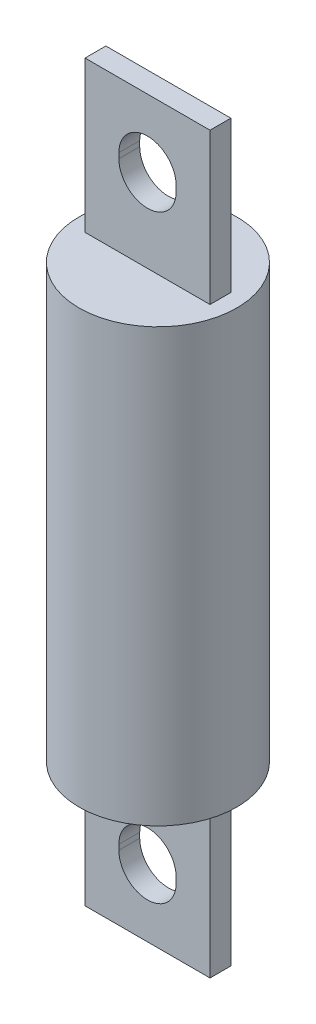
ISO-10303-21;
HEADER;
FILE_DESCRIPTION(('STEP AP214'),'2;1');
FILE_NAME('part.step','',(''),(''),'','','');
FILE_SCHEMA(('AUTOMOTIVE_DESIGN { 1 0 10303 214 1 1 1 1 }'));
ENDSEC;
DATA;
#1=APPLICATION_CONTEXT('core data for automotive mechanical design processes');
#2=APPLICATION_PROTOCOL_DEFINITION('international standard','automotive_design',2000,#1);
#3=PRODUCT_CONTEXT('',#1,'mechanical');
#4=PRODUCT('Part','Part','',(#3));
#5=PRODUCT_RELATED_PRODUCT_CATEGORY('part','',(#4));
#6=PRODUCT_DEFINITION_FORMATION('','',#4);
#7=PRODUCT_DEFINITION_CONTEXT('part definition',#1,'design');
#8=PRODUCT_DEFINITION('design','',#6,#7);
#9=PRODUCT_DEFINITION_SHAPE('','',#8);
#10=(LENGTH_UNIT() NAMED_UNIT(*) SI_UNIT(.MILLI.,.METRE.));
#11=(NAMED_UNIT(*) PLANE_ANGLE_UNIT() SI_UNIT($,.RADIAN.));
#12=(NAMED_UNIT(*) SI_UNIT($,.STERADIAN.) SOLID_ANGLE_UNIT());
#13=UNCERTAINTY_MEASURE_WITH_UNIT(LENGTH_MEASURE(1.E-05),#10,'distance_accuracy_value','');
#14=(GEOMETRIC_REPRESENTATION_CONTEXT(3) GLOBAL_UNCERTAINTY_ASSIGNED_CONTEXT((#13)) GLOBAL_UNIT_ASSIGNED_CONTEXT((#10,
#11,#12)) REPRESENTATION_CONTEXT('',''));
#15=CARTESIAN_POINT('',(0.,0.,0.));
#16=DIRECTION('',(0.,0.,1.));
#17=DIRECTION('',(1.,0.,0.));
#18=AXIS2_PLACEMENT_3D('',#15,#16,#17);
#19=CARTESIAN_POINT('',(-9.525,-23.0124,1.5875));
#20=DIRECTION('',(0.,0.,1.));
#21=DIRECTION('',(1.,0.,0.));
#22=AXIS2_PLACEMENT_3D('',#19,#20,#21);
#23=PLANE('',#22);
#24=DIRECTION('',(1.,0.,0.));
#25=VECTOR('',#24,1.);
#26=CARTESIAN_POINT('',(-9.525,0.,1.5875));
#27=LINE('',#26,#25);
#28=CARTESIAN_POINT('',(-9.525,0.,1.5875));
#29=VERTEX_POINT('',#28);
#30=CARTESIAN_POINT('',(9.525,0.,1.5875));
#31=VERTEX_POINT('',#30);
#32=EDGE_CURVE('E192',#29,#31,#27,.T.);
#33=ORIENTED_EDGE('',*,*,#32,.F.);
#34=DIRECTION('',(0.,1.,0.));
#35=VECTOR('',#34,1.);
#36=CARTESIAN_POINT('',(-9.525,-23.0124,1.5875));
#37=LINE('',#36,#35);
#38=CARTESIAN_POINT('',(-9.525,-23.0124,1.5875));
#39=VERTEX_POINT('',#38);
#40=EDGE_CURVE('E203',#39,#29,#37,.T.);
#41=ORIENTED_EDGE('',*,*,#40,.F.);
#42=DIRECTION('',(1.,0.,0.));
#43=VECTOR('',#42,1.);
#44=CARTESIAN_POINT('',(-9.525,-23.0124,1.5875));
#45=LINE('',#44,#43);
#46=CARTESIAN_POINT('',(9.525,-23.0124,1.5875));
#47=VERTEX_POINT('',#46);
#48=EDGE_CURVE('E179',#39,#47,#45,.T.);
#49=ORIENTED_EDGE('',*,*,#48,.T.);
#50=DIRECTION('',(0.,1.,0.));
#51=VECTOR('',#50,1.);
#52=CARTESIAN_POINT('',(9.525,-23.0124,1.5875));
#53=LINE('',#52,#51);
#54=EDGE_CURVE('E205',#47,#31,#53,.T.);
#55=ORIENTED_EDGE('',*,*,#54,.T.);
#56=EDGE_LOOP('',(#33,#41,#49,#55));
#57=FACE_BOUND('',#56,.T.);
#58=DIRECTION('',(0.,-1.,0.));
#59=VECTOR('',#58,1.);
#60=CARTESIAN_POINT('',(4.3688,-13.09751,1.5875));
#61=LINE('',#60,#59);
#62=CARTESIAN_POINT('',(4.3688,-12.3063,1.5875));
#63=VERTEX_POINT('',#62);
#64=CARTESIAN_POINT('',(4.3688,-13.09751,1.5875));
#65=VERTEX_POINT('',#64);
#66=EDGE_CURVE('E161',#63,#65,#61,.T.);
#67=ORIENTED_EDGE('',*,*,#66,.T.);
#68=CARTESIAN_POINT('',(0.,-13.09751,1.5875));
#69=DIRECTION('',(0.,0.,-1.));
#70=DIRECTION('',(1.,0.,0.));
#71=AXIS2_PLACEMENT_3D('',#68,#69,#70);
#72=CIRCLE('',#71,4.3688);
#73=CARTESIAN_POINT('',(-4.3688,-13.09751,1.5875));
#74=VERTEX_POINT('',#73);
#75=EDGE_CURVE('E51',#65,#74,#72,.T.);
#76=ORIENTED_EDGE('',*,*,#75,.T.);
#77=DIRECTION('',(0.,1.,0.));
#78=VECTOR('',#77,1.);
#79=CARTESIAN_POINT('',(-4.3688,-13.09751,1.5875));
#80=LINE('',#79,#78);
#81=CARTESIAN_POINT('',(-4.3688,-12.3063,1.5875));
#82=VERTEX_POINT('',#81);
#83=EDGE_CURVE('E166',#74,#82,#80,.T.);
#84=ORIENTED_EDGE('',*,*,#83,.T.);
#85=CARTESIAN_POINT('',(0.,-12.3063,1.5875));
#86=DIRECTION('',(0.,0.,-1.));
#87=DIRECTION('',(1.,0.,0.));
#88=AXIS2_PLACEMENT_3D('',#85,#86,#87);
#89=CIRCLE('',#88,4.3688);
#90=EDGE_CURVE('E152',#82,#63,#89,.T.);
#91=ORIENTED_EDGE('',*,*,#90,.T.);
#92=EDGE_LOOP('',(#67,#76,#84,#91));
#93=FACE_BOUND('',#92,.T.);
#94=ADVANCED_FACE('F36',(#57,#93),#23,.T.);
#95=CARTESIAN_POINT('',(-9.525,-23.0124,-1.5875));
#96=DIRECTION('',(0.,0.,-1.));
#97=DIRECTION('',(-1.,0.,0.));
#98=AXIS2_PLACEMENT_3D('',#95,#96,#97);
#99=PLANE('',#98);
#100=DIRECTION('',(-1.,0.,0.));
#101=VECTOR('',#100,1.);
#102=CARTESIAN_POINT('',(-9.525,0.,-1.5875));
#103=LINE('',#102,#101);
#104=CARTESIAN_POINT('',(9.525,0.,-1.5875));
#105=VERTEX_POINT('',#104);
#106=CARTESIAN_POINT('',(-9.525,0.,-1.5875));
#107=VERTEX_POINT('',#106);
#108=EDGE_CURVE('E180',#105,#107,#103,.T.);
#109=ORIENTED_EDGE('',*,*,#108,.F.);
#110=DIRECTION('',(0.,1.,0.));
#111=VECTOR('',#110,1.);
#112=CARTESIAN_POINT('',(9.525,-23.0124,-1.5875));
#113=LINE('',#112,#111);
#114=CARTESIAN_POINT('',(9.525,-23.0124,-1.5875));
#115=VERTEX_POINT('',#114);
#116=EDGE_CURVE('E189',#115,#105,#113,.T.);
#117=ORIENTED_EDGE('',*,*,#116,.F.);
#118=DIRECTION('',(-1.,0.,0.));
#119=VECTOR('',#118,1.);
#120=CARTESIAN_POINT('',(-9.525,-23.0124,-1.5875));
#121=LINE('',#120,#119);
#122=CARTESIAN_POINT('',(-9.525,-23.0124,-1.5875));
#123=VERTEX_POINT('',#122);
#124=EDGE_CURVE('E186',#115,#123,#121,.T.);
#125=ORIENTED_EDGE('',*,*,#124,.T.);
#126=DIRECTION('',(0.,1.,0.));
#127=VECTOR('',#126,1.);
#128=CARTESIAN_POINT('',(-9.525,-23.0124,-1.5875));
#129=LINE('',#128,#127);
#130=EDGE_CURVE('E201',#123,#107,#129,.T.);
#131=ORIENTED_EDGE('',*,*,#130,.T.);
#132=EDGE_LOOP('',(#109,#117,#125,#131));
#133=FACE_BOUND('',#132,.T.);
#134=DIRECTION('',(0.,-1.,0.));
#135=VECTOR('',#134,1.);
#136=CARTESIAN_POINT('',(-4.3688,-23.0124,-1.5875));
#137=LINE('',#136,#135);
#138=CARTESIAN_POINT('',(-4.3688,-12.3063,-1.58750000000001));
#139=VERTEX_POINT('',#138);
#140=CARTESIAN_POINT('',(-4.3688,-13.09751,-1.5875));
#141=VERTEX_POINT('',#140);
#142=EDGE_CURVE('E44',#139,#141,#137,.T.);
#143=ORIENTED_EDGE('',*,*,#142,.T.);
#144=CARTESIAN_POINT('',(0.,-13.09751,-1.5875));
#145=DIRECTION('',(0.,0.,-1.));
#146=DIRECTION('',(-1.,0.,0.));
#147=AXIS2_PLACEMENT_3D('',#144,#145,#146);
#148=CIRCLE('',#147,4.3688);
#149=CARTESIAN_POINT('',(4.3688,-13.09751,-1.5875));
#150=VERTEX_POINT('',#149);
#151=EDGE_CURVE('E11',#141,#150,#148,.F.);
#152=ORIENTED_EDGE('',*,*,#151,.T.);
#153=DIRECTION('',(0.,1.,0.));
#154=VECTOR('',#153,1.);
#155=CARTESIAN_POINT('',(4.3688,-23.0124,-1.5875));
#156=LINE('',#155,#154);
#157=CARTESIAN_POINT('',(4.3688,-12.3063,-1.5875));
#158=VERTEX_POINT('',#157);
#159=EDGE_CURVE('E277',#150,#158,#156,.T.);
#160=ORIENTED_EDGE('',*,*,#159,.T.);
#161=CARTESIAN_POINT('',(0.,-12.3063,-1.5875));
#162=DIRECTION('',(0.,0.,-1.));
#163=DIRECTION('',(-1.,0.,0.));
#164=AXIS2_PLACEMENT_3D('',#161,#162,#163);
#165=CIRCLE('',#164,4.3688);
#166=EDGE_CURVE('E155',#158,#139,#165,.F.);
#167=ORIENTED_EDGE('',*,*,#166,.T.);
#168=EDGE_LOOP('',(#143,#152,#160,#167));
#169=FACE_BOUND('',#168,.T.);
#170=ADVANCED_FACE('F283',(#133,#169),#99,.T.);
#171=CARTESIAN_POINT('',(0.,65.8876,0.));
#172=DIRECTION('',(0.,-1.,0.));
#173=DIRECTION('',(0.,0.,-1.));
#174=AXIS2_PLACEMENT_3D('',#171,#172,#173);
#175=CYLINDRICAL_SURFACE('',#174,12.0269);
#176=CARTESIAN_POINT('',(0.,65.8876,0.));
#177=DIRECTION('',(0.,1.,0.));
#178=DIRECTION('',(0.,0.,1.));
#179=AXIS2_PLACEMENT_3D('',#176,#177,#178);
#180=CIRCLE('',#179,12.0269);
#181=CARTESIAN_POINT('',(0.,65.8876,12.0269));
#182=VERTEX_POINT('',#181);
#183=EDGE_CURVE('E274',#182,#182,#180,.T.);
#184=ORIENTED_EDGE('',*,*,#183,.F.);
#185=EDGE_LOOP('',(#184));
#186=FACE_BOUND('',#185,.T.);
#187=CARTESIAN_POINT('',(0.,0.,0.));
#188=DIRECTION('',(0.,1.,0.));
#189=DIRECTION('',(0.,0.,1.));
#190=AXIS2_PLACEMENT_3D('',#187,#188,#189);
#191=CIRCLE('',#190,12.0269);
#192=CARTESIAN_POINT('',(0.,0.,12.0269));
#193=VERTEX_POINT('',#192);
#194=EDGE_CURVE('E273',#193,#193,#191,.T.);
#195=ORIENTED_EDGE('',*,*,#194,.T.);
#196=EDGE_LOOP('',(#195));
#197=FACE_BOUND('',#196,.T.);
#198=ADVANCED_FACE('F38',(#186,#197),#175,.T.);
#199=CARTESIAN_POINT('',(0.,65.8876,0.));
#200=DIRECTION('',(0.,1.,0.));
#201=DIRECTION('',(0.,0.,1.));
#202=AXIS2_PLACEMENT_3D('',#199,#200,#201);
#203=PLANE('',#202);
#204=DIRECTION('',(0.,0.,-1.));
#205=VECTOR('',#204,1.);
#206=CARTESIAN_POINT('',(9.525,65.8876,1.5875));
#207=LINE('',#206,#205);
#208=CARTESIAN_POINT('',(9.525,65.8876,1.5875));
#209=VERTEX_POINT('',#208);
#210=CARTESIAN_POINT('',(9.525,65.8876,-1.5875));
#211=VERTEX_POINT('',#210);
#212=EDGE_CURVE('E240',#209,#211,#207,.T.);
#213=ORIENTED_EDGE('',*,*,#212,.F.);
#214=DIRECTION('',(1.,0.,0.));
#215=VECTOR('',#214,1.);
#216=CARTESIAN_POINT('',(-9.525,65.8876,1.5875));
#217=LINE('',#216,#215);
#218=CARTESIAN_POINT('',(-9.525,65.8876,1.5875));
#219=VERTEX_POINT('',#218);
#220=EDGE_CURVE('E245',#219,#209,#217,.T.);
#221=ORIENTED_EDGE('',*,*,#220,.F.);
#222=DIRECTION('',(0.,0.,1.));
#223=VECTOR('',#222,1.);
#224=CARTESIAN_POINT('',(-9.525,65.8876,1.5875));
#225=LINE('',#224,#223);
#226=CARTESIAN_POINT('',(-9.525,65.8876,-1.5875));
#227=VERTEX_POINT('',#226);
#228=EDGE_CURVE('E257',#227,#219,#225,.T.);
#229=ORIENTED_EDGE('',*,*,#228,.F.);
#230=DIRECTION('',(-1.,0.,0.));
#231=VECTOR('',#230,1.);
#232=CARTESIAN_POINT('',(-9.525,65.8876,-1.5875));
#233=LINE('',#232,#231);
#234=EDGE_CURVE('E254',#211,#227,#233,.T.);
#235=ORIENTED_EDGE('',*,*,#234,.F.);
#236=EDGE_LOOP('',(#213,#221,#229,#235));
#237=FACE_BOUND('',#236,.T.);
#238=ORIENTED_EDGE('',*,*,#183,.T.);
#239=EDGE_LOOP('',(#238));
#240=FACE_BOUND('',#239,.T.);
#241=ADVANCED_FACE('F352',(#237,#240),#203,.T.);
#242=CARTESIAN_POINT('',(0.,0.,0.));
#243=DIRECTION('',(0.,1.,0.));
#244=DIRECTION('',(0.,0.,1.));
#245=AXIS2_PLACEMENT_3D('',#242,#243,#244);
#246=PLANE('',#245);
#247=ORIENTED_EDGE('',*,*,#32,.T.);
#248=DIRECTION('',(0.,0.,-1.));
#249=VECTOR('',#248,1.);
#250=CARTESIAN_POINT('',(9.525,0.,1.5875));
#251=LINE('',#250,#249);
#252=EDGE_CURVE('E173',#31,#105,#251,.T.);
#253=ORIENTED_EDGE('',*,*,#252,.T.);
#254=ORIENTED_EDGE('',*,*,#108,.T.);
#255=DIRECTION('',(0.,0.,1.));
#256=VECTOR('',#255,1.);
#257=CARTESIAN_POINT('',(-9.525,0.,1.5875));
#258=LINE('',#257,#256);
#259=EDGE_CURVE('E195',#107,#29,#258,.T.);
#260=ORIENTED_EDGE('',*,*,#259,.T.);
#261=EDGE_LOOP('',(#247,#253,#254,#260));
#262=FACE_BOUND('',#261,.T.);
#263=ORIENTED_EDGE('',*,*,#194,.F.);
#264=EDGE_LOOP('',(#263));
#265=FACE_BOUND('',#264,.T.);
#266=ADVANCED_FACE('F350',(#262,#265),#246,.F.);
#267=CARTESIAN_POINT('',(9.525,88.9,1.5875));
#268=DIRECTION('',(-1.,0.,0.));
#269=DIRECTION('',(0.,0.,1.));
#270=AXIS2_PLACEMENT_3D('',#267,#268,#269);
#271=PLANE('',#270);
#272=ORIENTED_EDGE('',*,*,#212,.T.);
#273=DIRECTION('',(0.,-1.,0.));
#274=VECTOR('',#273,1.);
#275=CARTESIAN_POINT('',(9.525,88.9,-1.5875));
#276=LINE('',#275,#274);
#277=CARTESIAN_POINT('',(9.525,88.9,-1.5875));
#278=VERTEX_POINT('',#277);
#279=EDGE_CURVE('E270',#278,#211,#276,.T.);
#280=ORIENTED_EDGE('',*,*,#279,.F.);
#281=DIRECTION('',(0.,0.,-1.));
#282=VECTOR('',#281,1.);
#283=CARTESIAN_POINT('',(9.525,88.9,1.5875));
#284=LINE('',#283,#282);
#285=CARTESIAN_POINT('',(9.525,88.9,1.5875));
#286=VERTEX_POINT('',#285);
#287=EDGE_CURVE('E241',#286,#278,#284,.T.);
#288=ORIENTED_EDGE('',*,*,#287,.F.);
#289=DIRECTION('',(0.,-1.,0.));
#290=VECTOR('',#289,1.);
#291=CARTESIAN_POINT('',(9.525,88.9,1.5875));
#292=LINE('',#291,#290);
#293=EDGE_CURVE('E251',#286,#209,#292,.T.);
#294=ORIENTED_EDGE('',*,*,#293,.T.);
#295=EDGE_LOOP('',(#272,#280,#288,#294));
#296=FACE_BOUND('',#295,.T.);
#297=ADVANCED_FACE('F346',(#296),#271,.F.);
#298=CARTESIAN_POINT('',(-9.525,88.9,-1.5875));
#299=DIRECTION('',(0.,0.,1.));
#300=DIRECTION('',(1.,0.,0.));
#301=AXIS2_PLACEMENT_3D('',#298,#299,#300);
#302=PLANE('',#301);
#303=DIRECTION('',(0.,1.,0.));
#304=VECTOR('',#303,1.);
#305=CARTESIAN_POINT('',(4.3688,88.9,-1.5875));
#306=LINE('',#305,#304);
#307=CARTESIAN_POINT('',(4.3688,78.1939,-1.58750000000001));
#308=VERTEX_POINT('',#307);
#309=CARTESIAN_POINT('',(4.3688,78.98511,-1.5875));
#310=VERTEX_POINT('',#309);
#311=EDGE_CURVE('E234',#308,#310,#306,.T.);
#312=ORIENTED_EDGE('',*,*,#311,.T.);
#313=CARTESIAN_POINT('',(0.,78.98511,-1.5875));
#314=DIRECTION('',(0.,0.,1.));
#315=DIRECTION('',(1.,0.,0.));
#316=AXIS2_PLACEMENT_3D('',#313,#314,#315);
#317=CIRCLE('',#316,4.3688);
#318=CARTESIAN_POINT('',(-4.3688,78.98511,-1.5875));
#319=VERTEX_POINT('',#318);
#320=EDGE_CURVE('E237',#310,#319,#317,.T.);
#321=ORIENTED_EDGE('',*,*,#320,.T.);
#322=DIRECTION('',(0.,-1.,0.));
#323=VECTOR('',#322,1.);
#324=CARTESIAN_POINT('',(-4.3688,88.9,-1.5875));
#325=LINE('',#324,#323);
#326=CARTESIAN_POINT('',(-4.3688,78.1939,-1.5875));
#327=VERTEX_POINT('',#326);
#328=EDGE_CURVE('E222',#319,#327,#325,.T.);
#329=ORIENTED_EDGE('',*,*,#328,.T.);
#330=CARTESIAN_POINT('',(0.,78.1939,-1.5875));
#331=DIRECTION('',(0.,0.,1.));
#332=DIRECTION('',(1.,0.,0.));
#333=AXIS2_PLACEMENT_3D('',#330,#331,#332);
#334=CIRCLE('',#333,4.3688);
#335=EDGE_CURVE('E231',#327,#308,#334,.T.);
#336=ORIENTED_EDGE('',*,*,#335,.T.);
#337=EDGE_LOOP('',(#312,#321,#329,#336));
#338=FACE_BOUND('',#337,.T.);
#339=ORIENTED_EDGE('',*,*,#234,.T.);
#340=DIRECTION('',(0.,-1.,0.));
#341=VECTOR('',#340,1.);
#342=CARTESIAN_POINT('',(-9.525,88.9,-1.5875));
#343=LINE('',#342,#341);
#344=CARTESIAN_POINT('',(-9.525,88.9,-1.5875));
#345=VERTEX_POINT('',#344);
#346=EDGE_CURVE('E267',#345,#227,#343,.T.);
#347=ORIENTED_EDGE('',*,*,#346,.F.);
#348=DIRECTION('',(-1.,0.,0.));
#349=VECTOR('',#348,1.);
#350=CARTESIAN_POINT('',(-9.525,88.9,-1.5875));
#351=LINE('',#350,#349);
#352=EDGE_CURVE('E244',#278,#345,#351,.T.);
#353=ORIENTED_EDGE('',*,*,#352,.F.);
#354=ORIENTED_EDGE('',*,*,#279,.T.);
#355=EDGE_LOOP('',(#339,#347,#353,#354));
#356=FACE_BOUND('',#355,.T.);
#357=ADVANCED_FACE('F342',(#338,#356),#302,.F.);
#358=CARTESIAN_POINT('',(-9.525,88.9,1.5875));
#359=DIRECTION('',(1.,0.,0.));
#360=DIRECTION('',(0.,0.,-1.));
#361=AXIS2_PLACEMENT_3D('',#358,#359,#360);
#362=PLANE('',#361);
#363=ORIENTED_EDGE('',*,*,#228,.T.);
#364=DIRECTION('',(0.,-1.,0.));
#365=VECTOR('',#364,1.);
#366=CARTESIAN_POINT('',(-9.525,88.9,1.5875));
#367=LINE('',#366,#365);
#368=CARTESIAN_POINT('',(-9.525,88.9,1.5875));
#369=VERTEX_POINT('',#368);
#370=EDGE_CURVE('E264',#369,#219,#367,.T.);
#371=ORIENTED_EDGE('',*,*,#370,.F.);
#372=DIRECTION('',(0.,0.,1.));
#373=VECTOR('',#372,1.);
#374=CARTESIAN_POINT('',(-9.525,88.9,1.5875));
#375=LINE('',#374,#373);
#376=EDGE_CURVE('E247',#345,#369,#375,.T.);
#377=ORIENTED_EDGE('',*,*,#376,.F.);
#378=ORIENTED_EDGE('',*,*,#346,.T.);
#379=EDGE_LOOP('',(#363,#371,#377,#378));
#380=FACE_BOUND('',#379,.T.);
#381=ADVANCED_FACE('F338',(#380),#362,.F.);
#382=CARTESIAN_POINT('',(-9.525,88.9,1.5875));
#383=DIRECTION('',(0.,0.,-1.));
#384=DIRECTION('',(-1.,0.,0.));
#385=AXIS2_PLACEMENT_3D('',#382,#383,#384);
#386=PLANE('',#385);
#387=DIRECTION('',(0.,-1.,0.));
#388=VECTOR('',#387,1.);
#389=CARTESIAN_POINT('',(-4.3688,78.98511,1.5875));
#390=LINE('',#389,#388);
#391=CARTESIAN_POINT('',(-4.3688,78.98511,1.5875));
#392=VERTEX_POINT('',#391);
#393=CARTESIAN_POINT('',(-4.3688,78.1939,1.5875));
#394=VERTEX_POINT('',#393);
#395=EDGE_CURVE('E210',#392,#394,#390,.T.);
#396=ORIENTED_EDGE('',*,*,#395,.F.);
#397=CARTESIAN_POINT('',(0.,78.98511,1.5875));
#398=DIRECTION('',(0.,0.,1.));
#399=DIRECTION('',(1.,0.,0.));
#400=AXIS2_PLACEMENT_3D('',#397,#398,#399);
#401=CIRCLE('',#400,4.3688);
#402=CARTESIAN_POINT('',(4.3688,78.98511,1.5875));
#403=VERTEX_POINT('',#402);
#404=EDGE_CURVE('E208',#403,#392,#401,.T.);
#405=ORIENTED_EDGE('',*,*,#404,.F.);
#406=DIRECTION('',(0.,1.,0.));
#407=VECTOR('',#406,1.);
#408=CARTESIAN_POINT('',(4.3688,78.98511,1.5875));
#409=LINE('',#408,#407);
#410=CARTESIAN_POINT('',(4.3688,78.1939,1.5875));
#411=VERTEX_POINT('',#410);
#412=EDGE_CURVE('E216',#411,#403,#409,.T.);
#413=ORIENTED_EDGE('',*,*,#412,.F.);
#414=CARTESIAN_POINT('',(0.,78.1939,1.5875));
#415=DIRECTION('',(0.,0.,1.));
#416=DIRECTION('',(1.,0.,0.));
#417=AXIS2_PLACEMENT_3D('',#414,#415,#416);
#418=CIRCLE('',#417,4.3688);
#419=EDGE_CURVE('E213',#394,#411,#418,.T.);
#420=ORIENTED_EDGE('',*,*,#419,.F.);
#421=EDGE_LOOP('',(#396,#405,#413,#420));
#422=FACE_BOUND('',#421,.T.);
#423=ORIENTED_EDGE('',*,*,#220,.T.);
#424=ORIENTED_EDGE('',*,*,#293,.F.);
#425=DIRECTION('',(1.,0.,0.));
#426=VECTOR('',#425,1.);
#427=CARTESIAN_POINT('',(-9.525,88.9,1.5875));
#428=LINE('',#427,#426);
#429=EDGE_CURVE('E249',#369,#286,#428,.T.);
#430=ORIENTED_EDGE('',*,*,#429,.F.);
#431=ORIENTED_EDGE('',*,*,#370,.T.);
#432=EDGE_LOOP('',(#423,#424,#430,#431));
#433=FACE_BOUND('',#432,.T.);
#434=ADVANCED_FACE('F334',(#422,#433),#386,.F.);
#435=CARTESIAN_POINT('',(0.,88.9,0.));
#436=DIRECTION('',(0.,-1.,0.));
#437=DIRECTION('',(0.,0.,-1.));
#438=AXIS2_PLACEMENT_3D('',#435,#436,#437);
#439=PLANE('',#438);
#440=ORIENTED_EDGE('',*,*,#287,.T.);
#441=ORIENTED_EDGE('',*,*,#352,.T.);
#442=ORIENTED_EDGE('',*,*,#376,.T.);
#443=ORIENTED_EDGE('',*,*,#429,.T.);
#444=EDGE_LOOP('',(#440,#441,#442,#443));
#445=FACE_BOUND('',#444,.T.);
#446=ADVANCED_FACE('F330',(#445),#439,.F.);
#447=CARTESIAN_POINT('',(0.,78.98511,-12.0269));
#448=DIRECTION('',(0.,0.,1.));
#449=DIRECTION('',(1.,0.,0.));
#450=AXIS2_PLACEMENT_3D('',#447,#448,#449);
#451=CYLINDRICAL_SURFACE('',#450,4.3688);
#452=DIRECTION('',(0.,0.,1.));
#453=VECTOR('',#452,1.);
#454=CARTESIAN_POINT('',(4.3688,78.98511,-12.0269));
#455=LINE('',#454,#453);
#456=EDGE_CURVE('E220',#310,#403,#455,.T.);
#457=ORIENTED_EDGE('',*,*,#456,.T.);
#458=ORIENTED_EDGE('',*,*,#404,.T.);
#459=DIRECTION('',(0.,0.,1.));
#460=VECTOR('',#459,1.);
#461=CARTESIAN_POINT('',(-4.3688,78.98511,-12.0269));
#462=LINE('',#461,#460);
#463=EDGE_CURVE('E219',#319,#392,#462,.T.);
#464=ORIENTED_EDGE('',*,*,#463,.F.);
#465=ORIENTED_EDGE('',*,*,#320,.F.);
#466=EDGE_LOOP('',(#457,#458,#464,#465));
#467=FACE_BOUND('',#466,.T.);
#468=ADVANCED_FACE('F320',(#467),#451,.F.);
#469=CARTESIAN_POINT('',(4.3688,78.98511,-12.0269));
#470=DIRECTION('',(1.,0.,0.));
#471=DIRECTION('',(0.,0.,-1.));
#472=AXIS2_PLACEMENT_3D('',#469,#470,#471);
#473=PLANE('',#472);
#474=DIRECTION('',(0.,0.,1.));
#475=VECTOR('',#474,1.);
#476=CARTESIAN_POINT('',(4.3688,78.1939,-12.0269));
#477=LINE('',#476,#475);
#478=EDGE_CURVE('E223',#308,#411,#477,.T.);
#479=ORIENTED_EDGE('',*,*,#478,.T.);
#480=ORIENTED_EDGE('',*,*,#412,.T.);
#481=ORIENTED_EDGE('',*,*,#456,.F.);
#482=ORIENTED_EDGE('',*,*,#311,.F.);
#483=EDGE_LOOP('',(#479,#480,#481,#482));
#484=FACE_BOUND('',#483,.T.);
#485=ADVANCED_FACE('F316',(#484),#473,.F.);
#486=CARTESIAN_POINT('',(0.,78.1939,-12.0269));
#487=DIRECTION('',(0.,0.,1.));
#488=DIRECTION('',(1.,0.,0.));
#489=AXIS2_PLACEMENT_3D('',#486,#487,#488);
#490=CYLINDRICAL_SURFACE('',#489,4.3688);
#491=DIRECTION('',(0.,0.,1.));
#492=VECTOR('',#491,1.);
#493=CARTESIAN_POINT('',(-4.3688,78.1939,-12.0269));
#494=LINE('',#493,#492);
#495=EDGE_CURVE('E225',#327,#394,#494,.T.);
#496=ORIENTED_EDGE('',*,*,#495,.T.);
#497=ORIENTED_EDGE('',*,*,#419,.T.);
#498=ORIENTED_EDGE('',*,*,#478,.F.);
#499=ORIENTED_EDGE('',*,*,#335,.F.);
#500=EDGE_LOOP('',(#496,#497,#498,#499));
#501=FACE_BOUND('',#500,.T.);
#502=ADVANCED_FACE('F319',(#501),#490,.F.);
#503=CARTESIAN_POINT('',(-4.3688,78.98511,-12.0269));
#504=DIRECTION('',(-1.,0.,0.));
#505=DIRECTION('',(0.,0.,1.));
#506=AXIS2_PLACEMENT_3D('',#503,#504,#505);
#507=PLANE('',#506);
#508=ORIENTED_EDGE('',*,*,#463,.T.);
#509=ORIENTED_EDGE('',*,*,#395,.T.);
#510=ORIENTED_EDGE('',*,*,#495,.F.);
#511=ORIENTED_EDGE('',*,*,#328,.F.);
#512=EDGE_LOOP('',(#508,#509,#510,#511));
#513=FACE_BOUND('',#512,.T.);
#514=ADVANCED_FACE('F314',(#513),#507,.F.);
#515=CARTESIAN_POINT('',(9.525,-23.0124,1.5875));
#516=DIRECTION('',(1.,0.,0.));
#517=DIRECTION('',(0.,0.,-1.));
#518=AXIS2_PLACEMENT_3D('',#515,#516,#517);
#519=PLANE('',#518);
#520=ORIENTED_EDGE('',*,*,#252,.F.);
#521=ORIENTED_EDGE('',*,*,#54,.F.);
#522=DIRECTION('',(0.,0.,-1.));
#523=VECTOR('',#522,1.);
#524=CARTESIAN_POINT('',(9.525,-23.0124,1.5875));
#525=LINE('',#524,#523);
#526=EDGE_CURVE('E176',#47,#115,#525,.T.);
#527=ORIENTED_EDGE('',*,*,#526,.T.);
#528=ORIENTED_EDGE('',*,*,#116,.T.);
#529=EDGE_LOOP('',(#520,#521,#527,#528));
#530=FACE_BOUND('',#529,.T.);
#531=ADVANCED_FACE('F311',(#530),#519,.T.);
#532=CARTESIAN_POINT('',(-9.525,-23.0124,1.5875));
#533=DIRECTION('',(-1.,0.,0.));
#534=DIRECTION('',(0.,0.,1.));
#535=AXIS2_PLACEMENT_3D('',#532,#533,#534);
#536=PLANE('',#535);
#537=ORIENTED_EDGE('',*,*,#259,.F.);
#538=ORIENTED_EDGE('',*,*,#130,.F.);
#539=DIRECTION('',(0.,0.,1.));
#540=VECTOR('',#539,1.);
#541=CARTESIAN_POINT('',(-9.525,-23.0124,1.5875));
#542=LINE('',#541,#540);
#543=EDGE_CURVE('E183',#123,#39,#542,.T.);
#544=ORIENTED_EDGE('',*,*,#543,.T.);
#545=ORIENTED_EDGE('',*,*,#40,.T.);
#546=EDGE_LOOP('',(#537,#538,#544,#545));
#547=FACE_BOUND('',#546,.T.);
#548=ADVANCED_FACE('F296',(#547),#536,.T.);
#549=CARTESIAN_POINT('',(0.,-23.0124,0.));
#550=DIRECTION('',(0.,1.,0.));
#551=DIRECTION('',(0.,0.,-1.));
#552=AXIS2_PLACEMENT_3D('',#549,#550,#551);
#553=PLANE('',#552);
#554=ORIENTED_EDGE('',*,*,#526,.F.);
#555=ORIENTED_EDGE('',*,*,#48,.F.);
#556=ORIENTED_EDGE('',*,*,#543,.F.);
#557=ORIENTED_EDGE('',*,*,#124,.F.);
#558=EDGE_LOOP('',(#554,#555,#556,#557));
#559=FACE_BOUND('',#558,.T.);
#560=ADVANCED_FACE('F289',(#559),#553,.F.);
#561=CARTESIAN_POINT('',(0.,-13.09751,-12.0269));
#562=DIRECTION('',(0.,0.,1.));
#563=DIRECTION('',(1.,0.,0.));
#564=AXIS2_PLACEMENT_3D('',#561,#562,#563);
#565=CYLINDRICAL_SURFACE('',#564,4.3688);
#566=DIRECTION('',(0.,0.,1.));
#567=VECTOR('',#566,1.);
#568=CARTESIAN_POINT('',(-4.3688,-13.09751,-12.0269));
#569=LINE('',#568,#567);
#570=EDGE_CURVE('E171',#141,#74,#569,.T.);
#571=ORIENTED_EDGE('',*,*,#570,.T.);
#572=ORIENTED_EDGE('',*,*,#75,.F.);
#573=DIRECTION('',(0.,0.,1.));
#574=VECTOR('',#573,1.);
#575=CARTESIAN_POINT('',(4.3688,-13.09751,-12.0269));
#576=LINE('',#575,#574);
#577=EDGE_CURVE('E158',#150,#65,#576,.T.);
#578=ORIENTED_EDGE('',*,*,#577,.F.);
#579=ORIENTED_EDGE('',*,*,#151,.F.);
#580=EDGE_LOOP('',(#571,#572,#578,#579));
#581=FACE_BOUND('',#580,.T.);
#582=ADVANCED_FACE('F287',(#581),#565,.F.);
#583=CARTESIAN_POINT('',(-4.3688,-13.09751,-12.0269));
#584=DIRECTION('',(1.,0.,0.));
#585=DIRECTION('',(0.,0.,-1.));
#586=AXIS2_PLACEMENT_3D('',#583,#584,#585);
#587=PLANE('',#586);
#588=DIRECTION('',(0.,0.,1.));
#589=VECTOR('',#588,1.);
#590=CARTESIAN_POINT('',(-4.3688,-12.3063,-12.0269));
#591=LINE('',#590,#589);
#592=EDGE_CURVE('E157',#139,#82,#591,.T.);
#593=ORIENTED_EDGE('',*,*,#592,.T.);
#594=ORIENTED_EDGE('',*,*,#83,.F.);
#595=ORIENTED_EDGE('',*,*,#570,.F.);
#596=ORIENTED_EDGE('',*,*,#142,.F.);
#597=EDGE_LOOP('',(#593,#594,#595,#596));
#598=FACE_BOUND('',#597,.T.);
#599=ADVANCED_FACE('F286',(#598),#587,.T.);
#600=CARTESIAN_POINT('',(0.,-12.3063,-12.0269));
#601=DIRECTION('',(0.,0.,1.));
#602=DIRECTION('',(1.,0.,0.));
#603=AXIS2_PLACEMENT_3D('',#600,#601,#602);
#604=CYLINDRICAL_SURFACE('',#603,4.3688);
#605=DIRECTION('',(0.,0.,1.));
#606=VECTOR('',#605,1.);
#607=CARTESIAN_POINT('',(4.3688,-12.3063,-12.0269));
#608=LINE('',#607,#606);
#609=EDGE_CURVE('E59',#158,#63,#608,.T.);
#610=ORIENTED_EDGE('',*,*,#609,.T.);
#611=ORIENTED_EDGE('',*,*,#90,.F.);
#612=ORIENTED_EDGE('',*,*,#592,.F.);
#613=ORIENTED_EDGE('',*,*,#166,.F.);
#614=EDGE_LOOP('',(#610,#611,#612,#613));
#615=FACE_BOUND('',#614,.T.);
#616=ADVANCED_FACE('F149',(#615),#604,.F.);
#617=CARTESIAN_POINT('',(4.3688,-13.09751,-12.0269));
#618=DIRECTION('',(-1.,0.,0.));
#619=DIRECTION('',(0.,0.,1.));
#620=AXIS2_PLACEMENT_3D('',#617,#618,#619);
#621=PLANE('',#620);
#622=ORIENTED_EDGE('',*,*,#577,.T.);
#623=ORIENTED_EDGE('',*,*,#66,.F.);
#624=ORIENTED_EDGE('',*,*,#609,.F.);
#625=ORIENTED_EDGE('',*,*,#159,.F.);
#626=EDGE_LOOP('',(#622,#623,#624,#625));
#627=FACE_BOUND('',#626,.T.);
#628=ADVANCED_FACE('F162',(#627),#621,.T.);
#629=CLOSED_SHELL('',(#94,#170,#198,#241,#266,#297,#357,#381,#434,#446,#468,#485,#502,#514,#531,
#548,#560,#582,#599,#616,#628));
#630=MANIFOLD_SOLID_BREP('B2',#629);
#631=ADVANCED_BREP_SHAPE_REPRESENTATION('',(#18,#630),#14);
#632=SHAPE_DEFINITION_REPRESENTATION(#9,#631);
ENDSEC;
END-ISO-10303-21;
